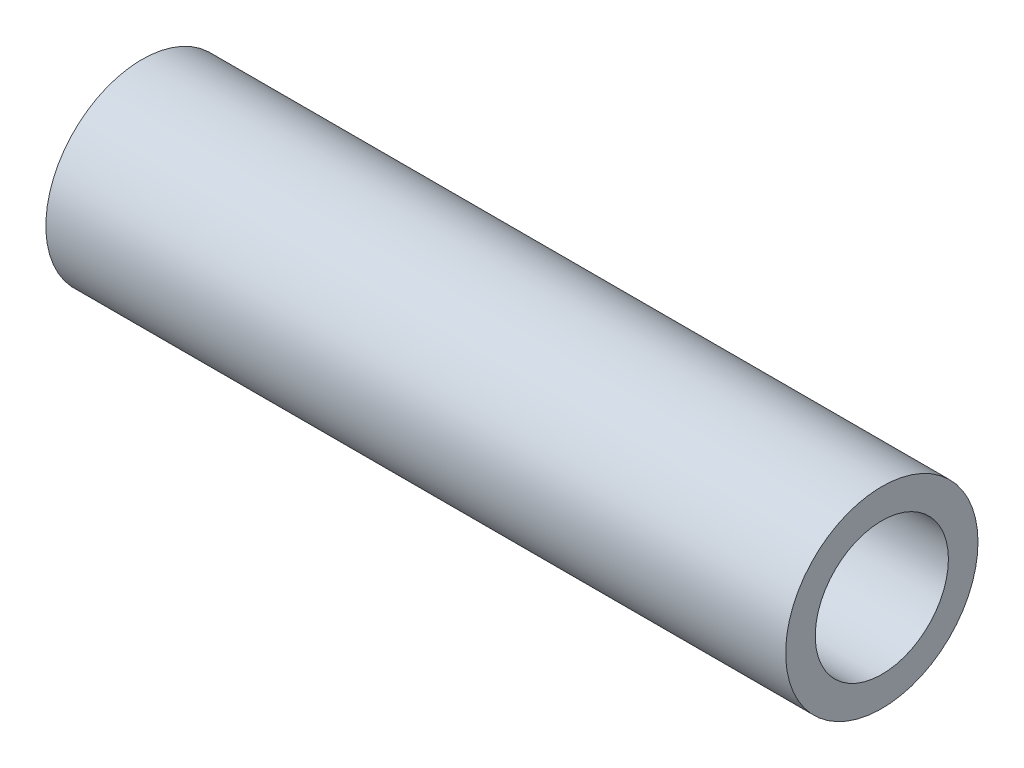
ISO-10303-21;
HEADER;
FILE_DESCRIPTION(('STEP AP214'),'2;1');
FILE_NAME('part.step','',(''),(''),'','','');
FILE_SCHEMA(('AUTOMOTIVE_DESIGN { 1 0 10303 214 1 1 1 1 }'));
ENDSEC;
DATA;
#1=APPLICATION_CONTEXT('core data for automotive mechanical design processes');
#2=APPLICATION_PROTOCOL_DEFINITION('international standard','automotive_design',2000,#1);
#3=PRODUCT_CONTEXT('',#1,'mechanical');
#4=PRODUCT('Part','Part','',(#3));
#5=PRODUCT_RELATED_PRODUCT_CATEGORY('part','',(#4));
#6=PRODUCT_DEFINITION_FORMATION('','',#4);
#7=PRODUCT_DEFINITION_CONTEXT('part definition',#1,'design');
#8=PRODUCT_DEFINITION('design','',#6,#7);
#9=PRODUCT_DEFINITION_SHAPE('','',#8);
#10=(LENGTH_UNIT() NAMED_UNIT(*) SI_UNIT(.MILLI.,.METRE.));
#11=(NAMED_UNIT(*) PLANE_ANGLE_UNIT() SI_UNIT($,.RADIAN.));
#12=(NAMED_UNIT(*) SI_UNIT($,.STERADIAN.) SOLID_ANGLE_UNIT());
#13=UNCERTAINTY_MEASURE_WITH_UNIT(LENGTH_MEASURE(1.E-05),#10,'distance_accuracy_value','');
#14=(GEOMETRIC_REPRESENTATION_CONTEXT(3) GLOBAL_UNCERTAINTY_ASSIGNED_CONTEXT((#13)) GLOBAL_UNIT_ASSIGNED_CONTEXT((#10,
#11,#12)) REPRESENTATION_CONTEXT('',''));
#15=CARTESIAN_POINT('',(0.,0.,0.));
#16=DIRECTION('',(0.,0.,1.));
#17=DIRECTION('',(1.,0.,0.));
#18=AXIS2_PLACEMENT_3D('',#15,#16,#17);
#19=CARTESIAN_POINT('',(100.,0.,0.));
#20=DIRECTION('',(1.,0.,0.));
#21=DIRECTION('',(0.,0.,-1.));
#22=AXIS2_PLACEMENT_3D('',#19,#20,#21);
#23=PLANE('',#22);
#24=CARTESIAN_POINT('',(100.,0.,0.));
#25=DIRECTION('',(1.,0.,0.));
#26=DIRECTION('',(0.,0.,-1.));
#27=AXIS2_PLACEMENT_3D('',#24,#25,#26);
#28=CIRCLE('',#27,13.);
#29=CARTESIAN_POINT('',(100.,0.,-13.));
#30=VERTEX_POINT('',#29);
#31=EDGE_CURVE('E10',#30,#30,#28,.T.);
#32=ORIENTED_EDGE('',*,*,#31,.T.);
#33=EDGE_LOOP('',(#32));
#34=FACE_BOUND('',#33,.T.);
#35=CARTESIAN_POINT('',(100.,0.,0.));
#36=DIRECTION('',(1.,0.,0.));
#37=DIRECTION('',(0.,0.,-1.));
#38=AXIS2_PLACEMENT_3D('',#35,#36,#37);
#39=CIRCLE('',#38,9.);
#40=CARTESIAN_POINT('',(100.,0.,-9.));
#41=VERTEX_POINT('',#40);
#42=EDGE_CURVE('E44',#41,#41,#39,.T.);
#43=ORIENTED_EDGE('',*,*,#42,.F.);
#44=EDGE_LOOP('',(#43));
#45=FACE_BOUND('',#44,.T.);
#46=ADVANCED_FACE('F33',(#34,#45),#23,.T.);
#47=CARTESIAN_POINT('',(0.,0.,0.));
#48=DIRECTION('',(1.,0.,0.));
#49=DIRECTION('',(0.,0.,-1.));
#50=AXIS2_PLACEMENT_3D('',#47,#48,#49);
#51=PLANE('',#50);
#52=CARTESIAN_POINT('',(0.,0.,0.));
#53=DIRECTION('',(1.,0.,0.));
#54=DIRECTION('',(0.,0.,-1.));
#55=AXIS2_PLACEMENT_3D('',#52,#53,#54);
#56=CIRCLE('',#55,13.);
#57=CARTESIAN_POINT('',(0.,0.,-13.));
#58=VERTEX_POINT('',#57);
#59=EDGE_CURVE('E37',#58,#58,#56,.T.);
#60=ORIENTED_EDGE('',*,*,#59,.F.);
#61=EDGE_LOOP('',(#60));
#62=FACE_BOUND('',#61,.T.);
#63=CARTESIAN_POINT('',(0.,0.,0.));
#64=DIRECTION('',(1.,0.,0.));
#65=DIRECTION('',(0.,0.,-1.));
#66=AXIS2_PLACEMENT_3D('',#63,#64,#65);
#67=CIRCLE('',#66,9.);
#68=CARTESIAN_POINT('',(0.,0.,-9.));
#69=VERTEX_POINT('',#68);
#70=EDGE_CURVE('E46',#69,#69,#67,.T.);
#71=ORIENTED_EDGE('',*,*,#70,.T.);
#72=EDGE_LOOP('',(#71));
#73=FACE_BOUND('',#72,.T.);
#74=ADVANCED_FACE('F56',(#62,#73),#51,.F.);
#75=CARTESIAN_POINT('',(100.,0.,0.));
#76=DIRECTION('',(-1.,0.,0.));
#77=DIRECTION('',(0.,0.,1.));
#78=AXIS2_PLACEMENT_3D('',#75,#76,#77);
#79=CYLINDRICAL_SURFACE('',#78,13.);
#80=ORIENTED_EDGE('',*,*,#31,.F.);
#81=EDGE_LOOP('',(#80));
#82=FACE_BOUND('',#81,.T.);
#83=ORIENTED_EDGE('',*,*,#59,.T.);
#84=EDGE_LOOP('',(#83));
#85=FACE_BOUND('',#84,.T.);
#86=ADVANCED_FACE('F35',(#82,#85),#79,.T.);
#87=CARTESIAN_POINT('',(100.,0.,0.));
#88=DIRECTION('',(-1.,0.,0.));
#89=DIRECTION('',(0.,0.,1.));
#90=AXIS2_PLACEMENT_3D('',#87,#88,#89);
#91=CYLINDRICAL_SURFACE('',#90,9.);
#92=ORIENTED_EDGE('',*,*,#42,.T.);
#93=EDGE_LOOP('',(#92));
#94=FACE_BOUND('',#93,.T.);
#95=ORIENTED_EDGE('',*,*,#70,.F.);
#96=EDGE_LOOP('',(#95));
#97=FACE_BOUND('',#96,.T.);
#98=ADVANCED_FACE('F52',(#94,#97),#91,.F.);
#99=CLOSED_SHELL('',(#46,#74,#86,#98));
#100=MANIFOLD_SOLID_BREP('B2',#99);
#101=ADVANCED_BREP_SHAPE_REPRESENTATION('',(#18,#100),#14);
#102=SHAPE_DEFINITION_REPRESENTATION(#9,#101);
ENDSEC;
END-ISO-10303-21;
